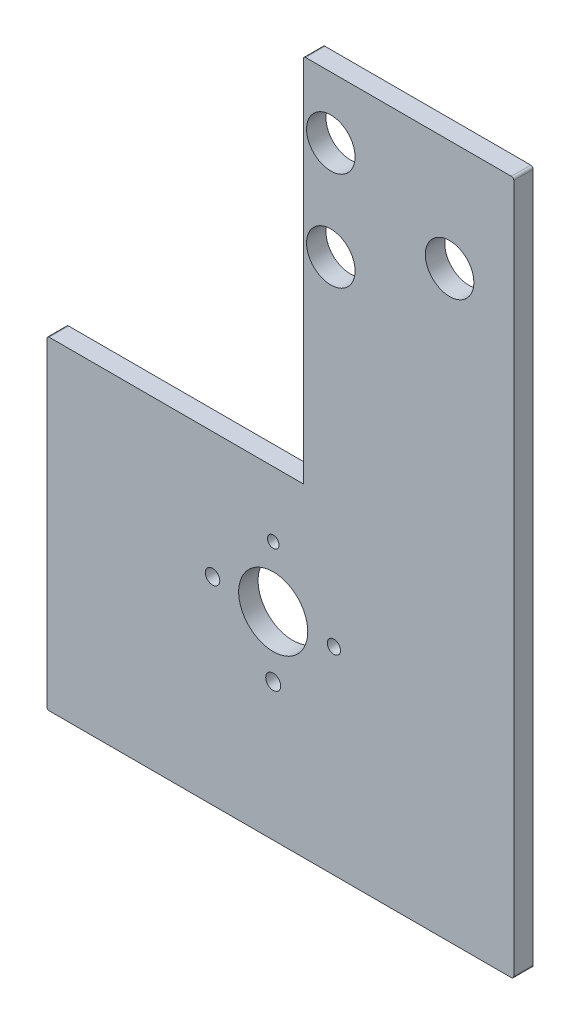
ISO-10303-21;
HEADER;
FILE_DESCRIPTION(('STEP AP214'),'2;1');
FILE_NAME('part.step','',(''),(''),'','','');
FILE_SCHEMA(('AUTOMOTIVE_DESIGN { 1 0 10303 214 1 1 1 1 }'));
ENDSEC;
DATA;
#1=APPLICATION_CONTEXT('core data for automotive mechanical design processes');
#2=APPLICATION_PROTOCOL_DEFINITION('international standard','automotive_design',2000,#1);
#3=PRODUCT_CONTEXT('',#1,'mechanical');
#4=PRODUCT('Part','Part','',(#3));
#5=PRODUCT_RELATED_PRODUCT_CATEGORY('part','',(#4));
#6=PRODUCT_DEFINITION_FORMATION('','',#4);
#7=PRODUCT_DEFINITION_CONTEXT('part definition',#1,'design');
#8=PRODUCT_DEFINITION('design','',#6,#7);
#9=PRODUCT_DEFINITION_SHAPE('','',#8);
#10=(LENGTH_UNIT() NAMED_UNIT(*) SI_UNIT(.MILLI.,.METRE.));
#11=(NAMED_UNIT(*) PLANE_ANGLE_UNIT() SI_UNIT($,.RADIAN.));
#12=(NAMED_UNIT(*) SI_UNIT($,.STERADIAN.) SOLID_ANGLE_UNIT());
#13=UNCERTAINTY_MEASURE_WITH_UNIT(LENGTH_MEASURE(1.E-05),#10,'distance_accuracy_value','');
#14=(GEOMETRIC_REPRESENTATION_CONTEXT(3) GLOBAL_UNCERTAINTY_ASSIGNED_CONTEXT((#13)) GLOBAL_UNIT_ASSIGNED_CONTEXT((#10,
#11,#12)) REPRESENTATION_CONTEXT('',''));
#15=CARTESIAN_POINT('',(0.,0.,0.));
#16=DIRECTION('',(0.,0.,1.));
#17=DIRECTION('',(1.,0.,0.));
#18=AXIS2_PLACEMENT_3D('',#15,#16,#17);
#19=CARTESIAN_POINT('',(4236.3612014789,3654.27949720903,8.));
#20=DIRECTION('',(0.,0.,1.));
#21=DIRECTION('',(1.,0.,0.));
#22=AXIS2_PLACEMENT_3D('',#19,#20,#21);
#23=PLANE('',#22);
#24=CARTESIAN_POINT('',(4113.22331786711,3734.81866702235,8.));
#25=DIRECTION('',(0.,0.,1.));
#26=DIRECTION('',(1.,0.,0.));
#27=AXIS2_PLACEMENT_3D('',#24,#25,#26);
#28=CIRCLE('',#27,2.97826076298102);
#29=CARTESIAN_POINT('',(4116.2015786301,3734.81866702235,8.));
#30=VERTEX_POINT('',#29);
#31=EDGE_CURVE('E291',#30,#30,#28,.T.);
#32=ORIENTED_EDGE('',*,*,#31,.F.);
#33=EDGE_LOOP('',(#32));
#34=FACE_BOUND('',#33,.T.);
#35=CARTESIAN_POINT('',(4138.22331786712,3709.81866702235,8.));
#36=DIRECTION('',(0.,0.,1.));
#37=DIRECTION('',(1.,0.,0.));
#38=AXIS2_PLACEMENT_3D('',#35,#36,#37);
#39=CIRCLE('',#38,3.0863289978673);
#40=CARTESIAN_POINT('',(4141.30964686498,3709.81866702235,8.));
#41=VERTEX_POINT('',#40);
#42=EDGE_CURVE('E293',#41,#41,#39,.T.);
#43=ORIENTED_EDGE('',*,*,#42,.F.);
#44=EDGE_LOOP('',(#43));
#45=FACE_BOUND('',#44,.T.);
#46=CARTESIAN_POINT('',(4163.22331786712,3734.81866702235,8.));
#47=DIRECTION('',(0.,0.,1.));
#48=DIRECTION('',(1.,0.,0.));
#49=AXIS2_PLACEMENT_3D('',#46,#47,#48);
#50=CIRCLE('',#49,2.71965257426806);
#51=CARTESIAN_POINT('',(4165.94297044138,3734.81866702235,8.));
#52=VERTEX_POINT('',#51);
#53=EDGE_CURVE('E299',#52,#52,#50,.T.);
#54=ORIENTED_EDGE('',*,*,#53,.F.);
#55=EDGE_LOOP('',(#54));
#56=FACE_BOUND('',#55,.T.);
#57=CARTESIAN_POINT('',(4138.22331786712,3759.81866702235,8.));
#58=DIRECTION('',(0.,0.,1.));
#59=DIRECTION('',(1.,0.,0.));
#60=AXIS2_PLACEMENT_3D('',#57,#58,#59);
#61=CIRCLE('',#60,2.38879268603217);
#62=CARTESIAN_POINT('',(4140.61211055315,3759.81866702235,8.));
#63=VERTEX_POINT('',#62);
#64=EDGE_CURVE('E305',#63,#63,#61,.T.);
#65=ORIENTED_EDGE('',*,*,#64,.F.);
#66=EDGE_LOOP('',(#65));
#67=FACE_BOUND('',#66,.T.);
#68=CARTESIAN_POINT('',(4161.96045626192,3873.28825994128,8.));
#69=DIRECTION('',(0.,0.,1.));
#70=DIRECTION('',(1.,0.,0.));
#71=AXIS2_PLACEMENT_3D('',#68,#69,#70);
#72=CIRCLE('',#71,9.99999999999979);
#73=CARTESIAN_POINT('',(4171.96045626192,3873.28825994128,8.));
#74=VERTEX_POINT('',#73);
#75=EDGE_CURVE('E320',#74,#74,#72,.T.);
#76=ORIENTED_EDGE('',*,*,#75,.F.);
#77=EDGE_LOOP('',(#76));
#78=FACE_BOUND('',#77,.T.);
#79=CARTESIAN_POINT('',(4210.91125389923,3893.62924206324,8.));
#80=DIRECTION('',(0.,0.,1.));
#81=DIRECTION('',(1.,0.,0.));
#82=AXIS2_PLACEMENT_3D('',#79,#80,#81);
#83=CIRCLE('',#82,9.99999999999979);
#84=CARTESIAN_POINT('',(4220.91125389923,3893.62924206324,8.));
#85=VERTEX_POINT('',#84);
#86=EDGE_CURVE('E155',#85,#85,#83,.T.);
#87=ORIENTED_EDGE('',*,*,#86,.F.);
#88=EDGE_LOOP('',(#87));
#89=FACE_BOUND('',#88,.T.);
#90=CARTESIAN_POINT('',(4236.3612014789,3654.27949720903,8.));
#91=DIRECTION('',(0.,0.,1.));
#92=DIRECTION('',(1.,0.,0.));
#93=AXIS2_PLACEMENT_3D('',#90,#91,#92);
#94=CIRCLE('',#93,0.99999999999989);
#95=CARTESIAN_POINT('',(4236.3612014789,3653.27949720903,8.));
#96=VERTEX_POINT('',#95);
#97=CARTESIAN_POINT('',(4237.3612014789,3654.27949720903,8.));
#98=VERTEX_POINT('',#97);
#99=EDGE_CURVE('E172',#96,#98,#94,.T.);
#100=ORIENTED_EDGE('',*,*,#99,.T.);
#101=DIRECTION('',(0.,1.,0.));
#102=VECTOR('',#101,1.);
#103=CARTESIAN_POINT('',(4237.3612014789,3654.27949720903,8.));
#104=LINE('',#103,#102);
#105=CARTESIAN_POINT('',(4237.3612014789,3938.28823462452,8.));
#106=VERTEX_POINT('',#105);
#107=EDGE_CURVE('E105',#98,#106,#104,.T.);
#108=ORIENTED_EDGE('',*,*,#107,.T.);
#109=CARTESIAN_POINT('',(4236.3612014789,3938.28823462452,8.));
#110=DIRECTION('',(0.,0.,1.));
#111=DIRECTION('',(1.,0.,0.));
#112=AXIS2_PLACEMENT_3D('',#109,#110,#111);
#113=CIRCLE('',#112,0.999999999999668);
#114=CARTESIAN_POINT('',(4236.3612014789,3939.28823462452,8.));
#115=VERTEX_POINT('',#114);
#116=EDGE_CURVE('E196',#106,#115,#113,.T.);
#117=ORIENTED_EDGE('',*,*,#116,.T.);
#118=DIRECTION('',(-1.,0.,0.));
#119=VECTOR('',#118,1.);
#120=CARTESIAN_POINT('',(4151.60608521763,3939.28823462452,8.));
#121=LINE('',#120,#119);
#122=CARTESIAN_POINT('',(4151.60608521763,3939.28823462452,8.));
#123=VERTEX_POINT('',#122);
#124=EDGE_CURVE('E215',#115,#123,#121,.T.);
#125=ORIENTED_EDGE('',*,*,#124,.T.);
#126=CARTESIAN_POINT('',(4151.60608521763,3938.28823462452,8.));
#127=DIRECTION('',(0.,0.,1.));
#128=DIRECTION('',(1.,0.,0.));
#129=AXIS2_PLACEMENT_3D('',#126,#127,#128);
#130=CIRCLE('',#129,0.999999999999668);
#131=CARTESIAN_POINT('',(4150.60608521763,3938.28823462452,8.));
#132=VERTEX_POINT('',#131);
#133=EDGE_CURVE('E212',#123,#132,#130,.T.);
#134=ORIENTED_EDGE('',*,*,#133,.T.);
#135=DIRECTION('',(0.,-1.,0.));
#136=VECTOR('',#135,1.);
#137=CARTESIAN_POINT('',(4150.60608521763,3786.62643227022,8.));
#138=LINE('',#137,#136);
#139=CARTESIAN_POINT('',(4150.60608521763,3786.62643227022,8.));
#140=VERTEX_POINT('',#139);
#141=EDGE_CURVE('E214',#132,#140,#138,.T.);
#142=ORIENTED_EDGE('',*,*,#141,.T.);
#143=DIRECTION('',(-1.,0.,0.));
#144=VECTOR('',#143,1.);
#145=CARTESIAN_POINT('',(4045.92072449099,3786.62643227022,8.));
#146=LINE('',#145,#144);
#147=CARTESIAN_POINT('',(4045.92072449099,3786.62643227022,8.));
#148=VERTEX_POINT('',#147);
#149=EDGE_CURVE('E217',#140,#148,#146,.T.);
#150=ORIENTED_EDGE('',*,*,#149,.T.);
#151=CARTESIAN_POINT('',(4045.92072449099,3785.62643227022,8.));
#152=DIRECTION('',(0.,0.,1.));
#153=DIRECTION('',(1.,0.,0.));
#154=AXIS2_PLACEMENT_3D('',#151,#152,#153);
#155=CIRCLE('',#154,1.00000000000011);
#156=CARTESIAN_POINT('',(4044.92072449099,3785.62643227022,8.));
#157=VERTEX_POINT('',#156);
#158=EDGE_CURVE('E133',#148,#157,#155,.T.);
#159=ORIENTED_EDGE('',*,*,#158,.T.);
#160=DIRECTION('',(0.,-1.,0.));
#161=VECTOR('',#160,1.);
#162=CARTESIAN_POINT('',(4044.92072449099,3654.27949720903,8.));
#163=LINE('',#162,#161);
#164=CARTESIAN_POINT('',(4044.92072449099,3654.27949720903,8.));
#165=VERTEX_POINT('',#164);
#166=EDGE_CURVE('E127',#157,#165,#163,.T.);
#167=ORIENTED_EDGE('',*,*,#166,.T.);
#168=CARTESIAN_POINT('',(4045.92072449099,3654.27949720903,8.));
#169=DIRECTION('',(0.,0.,1.));
#170=DIRECTION('',(1.,0.,0.));
#171=AXIS2_PLACEMENT_3D('',#168,#169,#170);
#172=CIRCLE('',#171,1.00000000000033);
#173=CARTESIAN_POINT('',(4045.92072449099,3653.27949720903,8.));
#174=VERTEX_POINT('',#173);
#175=EDGE_CURVE('E131',#165,#174,#172,.T.);
#176=ORIENTED_EDGE('',*,*,#175,.T.);
#177=DIRECTION('',(1.,0.,0.));
#178=VECTOR('',#177,1.);
#179=CARTESIAN_POINT('',(4236.3612014789,3653.27949720903,8.));
#180=LINE('',#179,#178);
#181=EDGE_CURVE('E53',#174,#96,#180,.T.);
#182=ORIENTED_EDGE('',*,*,#181,.T.);
#183=EDGE_LOOP('',(#100,#108,#117,#125,#134,#142,#150,#159,#167,#176,#182));
#184=FACE_BOUND('',#183,.T.);
#185=CARTESIAN_POINT('',(4161.96045626192,3913.97022418519,8.));
#186=DIRECTION('',(0.,0.,1.));
#187=DIRECTION('',(1.,0.,0.));
#188=AXIS2_PLACEMENT_3D('',#185,#186,#187);
#189=CIRCLE('',#188,9.99999999999979);
#190=CARTESIAN_POINT('',(4171.96045626192,3913.97022418519,8.));
#191=VERTEX_POINT('',#190);
#192=EDGE_CURVE('E326',#191,#191,#189,.T.);
#193=ORIENTED_EDGE('',*,*,#192,.F.);
#194=EDGE_LOOP('',(#193));
#195=FACE_BOUND('',#194,.T.);
#196=CARTESIAN_POINT('',(4138.22331786712,3734.81866702235,8.));
#197=DIRECTION('',(0.,0.,1.));
#198=DIRECTION('',(1.,0.,0.));
#199=AXIS2_PLACEMENT_3D('',#196,#197,#198);
#200=CIRCLE('',#199,14.2376703005214);
#201=CARTESIAN_POINT('',(4152.46098816764,3734.81866702235,8.));
#202=VERTEX_POINT('',#201);
#203=EDGE_CURVE('E314',#202,#202,#200,.T.);
#204=ORIENTED_EDGE('',*,*,#203,.F.);
#205=EDGE_LOOP('',(#204));
#206=FACE_BOUND('',#205,.T.);
#207=ADVANCED_FACE('F36',(#34,#45,#56,#67,#78,#89,#184,#195,#206),#23,.T.);
#208=CARTESIAN_POINT('',(4236.3612014789,3654.27949720903,0.));
#209=DIRECTION('',(0.,0.,1.));
#210=DIRECTION('',(1.,0.,0.));
#211=AXIS2_PLACEMENT_3D('',#208,#209,#210);
#212=PLANE('',#211);
#213=CARTESIAN_POINT('',(4113.22331786711,3734.81866702235,0.));
#214=DIRECTION('',(0.,0.,1.));
#215=DIRECTION('',(1.,0.,0.));
#216=AXIS2_PLACEMENT_3D('',#213,#214,#215);
#217=CIRCLE('',#216,2.97826076298102);
#218=CARTESIAN_POINT('',(4116.2015786301,3734.81866702235,0.));
#219=VERTEX_POINT('',#218);
#220=EDGE_CURVE('E289',#219,#219,#217,.T.);
#221=ORIENTED_EDGE('',*,*,#220,.T.);
#222=EDGE_LOOP('',(#221));
#223=FACE_BOUND('',#222,.T.);
#224=CARTESIAN_POINT('',(4138.22331786712,3709.81866702235,0.));
#225=DIRECTION('',(0.,0.,1.));
#226=DIRECTION('',(1.,0.,0.));
#227=AXIS2_PLACEMENT_3D('',#224,#225,#226);
#228=CIRCLE('',#227,3.0863289978673);
#229=CARTESIAN_POINT('',(4141.30964686498,3709.81866702235,0.));
#230=VERTEX_POINT('',#229);
#231=EDGE_CURVE('E296',#230,#230,#228,.T.);
#232=ORIENTED_EDGE('',*,*,#231,.T.);
#233=EDGE_LOOP('',(#232));
#234=FACE_BOUND('',#233,.T.);
#235=CARTESIAN_POINT('',(4163.22331786712,3734.81866702235,0.));
#236=DIRECTION('',(0.,0.,1.));
#237=DIRECTION('',(1.,0.,0.));
#238=AXIS2_PLACEMENT_3D('',#235,#236,#237);
#239=CIRCLE('',#238,2.71965257426806);
#240=CARTESIAN_POINT('',(4165.94297044138,3734.81866702235,0.));
#241=VERTEX_POINT('',#240);
#242=EDGE_CURVE('E302',#241,#241,#239,.T.);
#243=ORIENTED_EDGE('',*,*,#242,.T.);
#244=EDGE_LOOP('',(#243));
#245=FACE_BOUND('',#244,.T.);
#246=CARTESIAN_POINT('',(4138.22331786712,3759.81866702235,0.));
#247=DIRECTION('',(0.,0.,1.));
#248=DIRECTION('',(1.,0.,0.));
#249=AXIS2_PLACEMENT_3D('',#246,#247,#248);
#250=CIRCLE('',#249,2.38879268603217);
#251=CARTESIAN_POINT('',(4140.61211055315,3759.81866702235,0.));
#252=VERTEX_POINT('',#251);
#253=EDGE_CURVE('E308',#252,#252,#250,.T.);
#254=ORIENTED_EDGE('',*,*,#253,.T.);
#255=EDGE_LOOP('',(#254));
#256=FACE_BOUND('',#255,.T.);
#257=CARTESIAN_POINT('',(4161.96045626192,3873.28825994128,0.));
#258=DIRECTION('',(0.,0.,1.));
#259=DIRECTION('',(1.,0.,0.));
#260=AXIS2_PLACEMENT_3D('',#257,#258,#259);
#261=CIRCLE('',#260,9.99999999999979);
#262=CARTESIAN_POINT('',(4171.96045626192,3873.28825994128,0.));
#263=VERTEX_POINT('',#262);
#264=EDGE_CURVE('E317',#263,#263,#261,.T.);
#265=ORIENTED_EDGE('',*,*,#264,.T.);
#266=EDGE_LOOP('',(#265));
#267=FACE_BOUND('',#266,.T.);
#268=CARTESIAN_POINT('',(4210.91125389923,3893.62924206324,0.));
#269=DIRECTION('',(0.,0.,1.));
#270=DIRECTION('',(1.,0.,0.));
#271=AXIS2_PLACEMENT_3D('',#268,#269,#270);
#272=CIRCLE('',#271,9.99999999999979);
#273=CARTESIAN_POINT('',(4220.91125389923,3893.62924206324,0.));
#274=VERTEX_POINT('',#273);
#275=EDGE_CURVE('E329',#274,#274,#272,.T.);
#276=ORIENTED_EDGE('',*,*,#275,.T.);
#277=EDGE_LOOP('',(#276));
#278=FACE_BOUND('',#277,.T.);
#279=CARTESIAN_POINT('',(4236.3612014789,3654.27949720903,0.));
#280=DIRECTION('',(0.,0.,1.));
#281=DIRECTION('',(1.,0.,0.));
#282=AXIS2_PLACEMENT_3D('',#279,#280,#281);
#283=CIRCLE('',#282,0.99999999999989);
#284=CARTESIAN_POINT('',(4236.3612014789,3653.27949720903,0.));
#285=VERTEX_POINT('',#284);
#286=CARTESIAN_POINT('',(4237.3612014789,3654.27949720903,0.));
#287=VERTEX_POINT('',#286);
#288=EDGE_CURVE('E151',#285,#287,#283,.T.);
#289=ORIENTED_EDGE('',*,*,#288,.F.);
#290=DIRECTION('',(1.,0.,0.));
#291=VECTOR('',#290,1.);
#292=CARTESIAN_POINT('',(4236.3612014789,3653.27949720903,0.));
#293=LINE('',#292,#291);
#294=CARTESIAN_POINT('',(4045.92072449099,3653.27949720903,0.));
#295=VERTEX_POINT('',#294);
#296=EDGE_CURVE('E97',#295,#285,#293,.T.);
#297=ORIENTED_EDGE('',*,*,#296,.F.);
#298=CARTESIAN_POINT('',(4045.92072449099,3654.27949720903,0.));
#299=DIRECTION('',(0.,0.,1.));
#300=DIRECTION('',(1.,0.,0.));
#301=AXIS2_PLACEMENT_3D('',#298,#299,#300);
#302=CIRCLE('',#301,1.00000000000033);
#303=CARTESIAN_POINT('',(4044.92072449099,3654.27949720903,0.));
#304=VERTEX_POINT('',#303);
#305=EDGE_CURVE('E91',#304,#295,#302,.T.);
#306=ORIENTED_EDGE('',*,*,#305,.F.);
#307=DIRECTION('',(0.,-1.,0.));
#308=VECTOR('',#307,1.);
#309=CARTESIAN_POINT('',(4044.92072449099,3654.27949720903,0.));
#310=LINE('',#309,#308);
#311=CARTESIAN_POINT('',(4044.92072449099,3785.62643227022,0.));
#312=VERTEX_POINT('',#311);
#313=EDGE_CURVE('E141',#312,#304,#310,.T.);
#314=ORIENTED_EDGE('',*,*,#313,.F.);
#315=CARTESIAN_POINT('',(4045.92072449099,3785.62643227022,0.));
#316=DIRECTION('',(0.,0.,1.));
#317=DIRECTION('',(1.,0.,0.));
#318=AXIS2_PLACEMENT_3D('',#315,#316,#317);
#319=CIRCLE('',#318,1.00000000000011);
#320=CARTESIAN_POINT('',(4045.92072449099,3786.62643227022,0.));
#321=VERTEX_POINT('',#320);
#322=EDGE_CURVE('E167',#321,#312,#319,.T.);
#323=ORIENTED_EDGE('',*,*,#322,.F.);
#324=DIRECTION('',(-1.,0.,0.));
#325=VECTOR('',#324,1.);
#326=CARTESIAN_POINT('',(4045.92072449099,3786.62643227022,0.));
#327=LINE('',#326,#325);
#328=CARTESIAN_POINT('',(4150.60608521763,3786.62643227022,0.));
#329=VERTEX_POINT('',#328);
#330=EDGE_CURVE('E165',#329,#321,#327,.T.);
#331=ORIENTED_EDGE('',*,*,#330,.F.);
#332=DIRECTION('',(0.,-1.,0.));
#333=VECTOR('',#332,1.);
#334=CARTESIAN_POINT('',(4150.60608521763,3786.62643227022,0.));
#335=LINE('',#334,#333);
#336=CARTESIAN_POINT('',(4150.60608521763,3938.28823462452,0.));
#337=VERTEX_POINT('',#336);
#338=EDGE_CURVE('E163',#337,#329,#335,.T.);
#339=ORIENTED_EDGE('',*,*,#338,.F.);
#340=CARTESIAN_POINT('',(4151.60608521763,3938.28823462452,0.));
#341=DIRECTION('',(0.,0.,1.));
#342=DIRECTION('',(1.,0.,0.));
#343=AXIS2_PLACEMENT_3D('',#340,#341,#342);
#344=CIRCLE('',#343,0.999999999999668);
#345=CARTESIAN_POINT('',(4151.60608521763,3939.28823462452,0.));
#346=VERTEX_POINT('',#345);
#347=EDGE_CURVE('E161',#346,#337,#344,.T.);
#348=ORIENTED_EDGE('',*,*,#347,.F.);
#349=DIRECTION('',(-1.,0.,0.));
#350=VECTOR('',#349,1.);
#351=CARTESIAN_POINT('',(4151.60608521763,3939.28823462452,0.));
#352=LINE('',#351,#350);
#353=CARTESIAN_POINT('',(4236.3612014789,3939.28823462452,0.));
#354=VERTEX_POINT('',#353);
#355=EDGE_CURVE('E159',#354,#346,#352,.T.);
#356=ORIENTED_EDGE('',*,*,#355,.F.);
#357=CARTESIAN_POINT('',(4236.3612014789,3938.28823462452,0.));
#358=DIRECTION('',(0.,0.,1.));
#359=DIRECTION('',(1.,0.,0.));
#360=AXIS2_PLACEMENT_3D('',#357,#358,#359);
#361=CIRCLE('',#360,0.999999999999668);
#362=CARTESIAN_POINT('',(4237.3612014789,3938.28823462452,0.));
#363=VERTEX_POINT('',#362);
#364=EDGE_CURVE('E157',#363,#354,#361,.T.);
#365=ORIENTED_EDGE('',*,*,#364,.F.);
#366=DIRECTION('',(0.,1.,0.));
#367=VECTOR('',#366,1.);
#368=CARTESIAN_POINT('',(4237.3612014789,3654.27949720903,0.));
#369=LINE('',#368,#367);
#370=EDGE_CURVE('E154',#287,#363,#369,.T.);
#371=ORIENTED_EDGE('',*,*,#370,.F.);
#372=EDGE_LOOP('',(#289,#297,#306,#314,#323,#331,#339,#348,#356,#365,#371));
#373=FACE_BOUND('',#372,.T.);
#374=CARTESIAN_POINT('',(4161.96045626192,3913.97022418519,0.));
#375=DIRECTION('',(0.,0.,1.));
#376=DIRECTION('',(1.,0.,0.));
#377=AXIS2_PLACEMENT_3D('',#374,#375,#376);
#378=CIRCLE('',#377,9.99999999999979);
#379=CARTESIAN_POINT('',(4171.96045626192,3913.97022418519,0.));
#380=VERTEX_POINT('',#379);
#381=EDGE_CURVE('E323',#380,#380,#378,.T.);
#382=ORIENTED_EDGE('',*,*,#381,.T.);
#383=EDGE_LOOP('',(#382));
#384=FACE_BOUND('',#383,.T.);
#385=CARTESIAN_POINT('',(4138.22331786712,3734.81866702235,0.));
#386=DIRECTION('',(0.,0.,1.));
#387=DIRECTION('',(1.,0.,0.));
#388=AXIS2_PLACEMENT_3D('',#385,#386,#387);
#389=CIRCLE('',#388,14.2376703005214);
#390=CARTESIAN_POINT('',(4152.46098816764,3734.81866702235,0.));
#391=VERTEX_POINT('',#390);
#392=EDGE_CURVE('E311',#391,#391,#389,.T.);
#393=ORIENTED_EDGE('',*,*,#392,.T.);
#394=EDGE_LOOP('',(#393));
#395=FACE_BOUND('',#394,.T.);
#396=ADVANCED_FACE('F200',(#223,#234,#245,#256,#267,#278,#373,#384,#395),#212,.F.);
#397=CARTESIAN_POINT('',(4236.3612014789,3654.27949720903,8.));
#398=DIRECTION('',(0.,0.,-1.));
#399=DIRECTION('',(-1.,0.,0.));
#400=AXIS2_PLACEMENT_3D('',#397,#398,#399);
#401=CYLINDRICAL_SURFACE('',#400,0.99999999999989);
#402=ORIENTED_EDGE('',*,*,#288,.T.);
#403=DIRECTION('',(0.,0.,-1.));
#404=VECTOR('',#403,1.);
#405=CARTESIAN_POINT('',(4237.3612014789,3654.27949720903,8.));
#406=LINE('',#405,#404);
#407=EDGE_CURVE('E11',#98,#287,#406,.T.);
#408=ORIENTED_EDGE('',*,*,#407,.F.);
#409=ORIENTED_EDGE('',*,*,#99,.F.);
#410=DIRECTION('',(0.,0.,-1.));
#411=VECTOR('',#410,1.);
#412=CARTESIAN_POINT('',(4236.3612014789,3653.27949720903,8.));
#413=LINE('',#412,#411);
#414=EDGE_CURVE('E147',#96,#285,#413,.T.);
#415=ORIENTED_EDGE('',*,*,#414,.T.);
#416=EDGE_LOOP('',(#402,#408,#409,#415));
#417=FACE_BOUND('',#416,.T.);
#418=ADVANCED_FACE('F38',(#417),#401,.T.);
#419=CARTESIAN_POINT('',(4237.3612014789,3654.27949720903,8.));
#420=DIRECTION('',(-1.,0.,0.));
#421=DIRECTION('',(0.,0.,1.));
#422=AXIS2_PLACEMENT_3D('',#419,#420,#421);
#423=PLANE('',#422);
#424=ORIENTED_EDGE('',*,*,#370,.T.);
#425=DIRECTION('',(0.,0.,-1.));
#426=VECTOR('',#425,1.);
#427=CARTESIAN_POINT('',(4237.3612014789,3938.28823462452,8.));
#428=LINE('',#427,#426);
#429=EDGE_CURVE('E45',#106,#363,#428,.T.);
#430=ORIENTED_EDGE('',*,*,#429,.F.);
#431=ORIENTED_EDGE('',*,*,#107,.F.);
#432=ORIENTED_EDGE('',*,*,#407,.T.);
#433=EDGE_LOOP('',(#424,#430,#431,#432));
#434=FACE_BOUND('',#433,.T.);
#435=ADVANCED_FACE('F465',(#434),#423,.F.);
#436=CARTESIAN_POINT('',(4236.3612014789,3938.28823462452,8.));
#437=DIRECTION('',(0.,0.,-1.));
#438=DIRECTION('',(-1.,0.,0.));
#439=AXIS2_PLACEMENT_3D('',#436,#437,#438);
#440=CYLINDRICAL_SURFACE('',#439,0.999999999999668);
#441=ORIENTED_EDGE('',*,*,#364,.T.);
#442=DIRECTION('',(0.,0.,-1.));
#443=VECTOR('',#442,1.);
#444=CARTESIAN_POINT('',(4236.3612014789,3939.28823462452,8.));
#445=LINE('',#444,#443);
#446=EDGE_CURVE('E188',#115,#354,#445,.T.);
#447=ORIENTED_EDGE('',*,*,#446,.F.);
#448=ORIENTED_EDGE('',*,*,#116,.F.);
#449=ORIENTED_EDGE('',*,*,#429,.T.);
#450=EDGE_LOOP('',(#441,#447,#448,#449));
#451=FACE_BOUND('',#450,.T.);
#452=ADVANCED_FACE('F194',(#451),#440,.T.);
#453=CARTESIAN_POINT('',(4151.60608521763,3939.28823462452,8.));
#454=DIRECTION('',(0.,-1.,0.));
#455=DIRECTION('',(0.,0.,-1.));
#456=AXIS2_PLACEMENT_3D('',#453,#454,#455);
#457=PLANE('',#456);
#458=ORIENTED_EDGE('',*,*,#355,.T.);
#459=DIRECTION('',(0.,0.,-1.));
#460=VECTOR('',#459,1.);
#461=CARTESIAN_POINT('',(4151.60608521763,3939.28823462452,8.));
#462=LINE('',#461,#460);
#463=EDGE_CURVE('E185',#123,#346,#462,.T.);
#464=ORIENTED_EDGE('',*,*,#463,.F.);
#465=ORIENTED_EDGE('',*,*,#124,.F.);
#466=ORIENTED_EDGE('',*,*,#446,.T.);
#467=EDGE_LOOP('',(#458,#464,#465,#466));
#468=FACE_BOUND('',#467,.T.);
#469=ADVANCED_FACE('F206',(#468),#457,.F.);
#470=CARTESIAN_POINT('',(4151.60608521763,3938.28823462452,8.));
#471=DIRECTION('',(0.,0.,-1.));
#472=DIRECTION('',(-1.,0.,0.));
#473=AXIS2_PLACEMENT_3D('',#470,#471,#472);
#474=CYLINDRICAL_SURFACE('',#473,0.999999999999668);
#475=ORIENTED_EDGE('',*,*,#347,.T.);
#476=DIRECTION('',(0.,0.,-1.));
#477=VECTOR('',#476,1.);
#478=CARTESIAN_POINT('',(4150.60608521763,3938.28823462452,8.));
#479=LINE('',#478,#477);
#480=EDGE_CURVE('E182',#132,#337,#479,.T.);
#481=ORIENTED_EDGE('',*,*,#480,.F.);
#482=ORIENTED_EDGE('',*,*,#133,.F.);
#483=ORIENTED_EDGE('',*,*,#463,.T.);
#484=EDGE_LOOP('',(#475,#481,#482,#483));
#485=FACE_BOUND('',#484,.T.);
#486=ADVANCED_FACE('F210',(#485),#474,.T.);
#487=CARTESIAN_POINT('',(4150.60608521763,3786.62643227022,8.));
#488=DIRECTION('',(1.,0.,0.));
#489=DIRECTION('',(0.,0.,-1.));
#490=AXIS2_PLACEMENT_3D('',#487,#488,#489);
#491=PLANE('',#490);
#492=ORIENTED_EDGE('',*,*,#338,.T.);
#493=DIRECTION('',(0.,0.,-1.));
#494=VECTOR('',#493,1.);
#495=CARTESIAN_POINT('',(4150.60608521763,3786.62643227022,8.));
#496=LINE('',#495,#494);
#497=EDGE_CURVE('E179',#140,#329,#496,.T.);
#498=ORIENTED_EDGE('',*,*,#497,.F.);
#499=ORIENTED_EDGE('',*,*,#141,.F.);
#500=ORIENTED_EDGE('',*,*,#480,.T.);
#501=EDGE_LOOP('',(#492,#498,#499,#500));
#502=FACE_BOUND('',#501,.T.);
#503=ADVANCED_FACE('F431',(#502),#491,.F.);
#504=CARTESIAN_POINT('',(4045.92072449099,3786.62643227022,8.));
#505=DIRECTION('',(0.,-1.,0.));
#506=DIRECTION('',(0.,0.,-1.));
#507=AXIS2_PLACEMENT_3D('',#504,#505,#506);
#508=PLANE('',#507);
#509=ORIENTED_EDGE('',*,*,#330,.T.);
#510=DIRECTION('',(0.,0.,-1.));
#511=VECTOR('',#510,1.);
#512=CARTESIAN_POINT('',(4045.92072449099,3786.62643227022,8.));
#513=LINE('',#512,#511);
#514=EDGE_CURVE('E176',#148,#321,#513,.T.);
#515=ORIENTED_EDGE('',*,*,#514,.F.);
#516=ORIENTED_EDGE('',*,*,#149,.F.);
#517=ORIENTED_EDGE('',*,*,#497,.T.);
#518=EDGE_LOOP('',(#509,#515,#516,#517));
#519=FACE_BOUND('',#518,.T.);
#520=ADVANCED_FACE('F226',(#519),#508,.F.);
#521=CARTESIAN_POINT('',(4045.92072449099,3785.62643227022,8.));
#522=DIRECTION('',(0.,0.,-1.));
#523=DIRECTION('',(-1.,0.,0.));
#524=AXIS2_PLACEMENT_3D('',#521,#522,#523);
#525=CYLINDRICAL_SURFACE('',#524,1.00000000000011);
#526=ORIENTED_EDGE('',*,*,#322,.T.);
#527=DIRECTION('',(0.,0.,-1.));
#528=VECTOR('',#527,1.);
#529=CARTESIAN_POINT('',(4044.92072449099,3785.62643227022,8.));
#530=LINE('',#529,#528);
#531=EDGE_CURVE('E142',#157,#312,#530,.T.);
#532=ORIENTED_EDGE('',*,*,#531,.F.);
#533=ORIENTED_EDGE('',*,*,#158,.F.);
#534=ORIENTED_EDGE('',*,*,#514,.T.);
#535=EDGE_LOOP('',(#526,#532,#533,#534));
#536=FACE_BOUND('',#535,.T.);
#537=ADVANCED_FACE('F230',(#536),#525,.T.);
#538=CARTESIAN_POINT('',(4044.92072449099,3654.27949720903,8.));
#539=DIRECTION('',(1.,0.,0.));
#540=DIRECTION('',(0.,0.,-1.));
#541=AXIS2_PLACEMENT_3D('',#538,#539,#540);
#542=PLANE('',#541);
#543=ORIENTED_EDGE('',*,*,#313,.T.);
#544=DIRECTION('',(0.,0.,-1.));
#545=VECTOR('',#544,1.);
#546=CARTESIAN_POINT('',(4044.92072449099,3654.27949720903,8.));
#547=LINE('',#546,#545);
#548=EDGE_CURVE('E138',#165,#304,#547,.T.);
#549=ORIENTED_EDGE('',*,*,#548,.F.);
#550=ORIENTED_EDGE('',*,*,#166,.F.);
#551=ORIENTED_EDGE('',*,*,#531,.T.);
#552=EDGE_LOOP('',(#543,#549,#550,#551));
#553=FACE_BOUND('',#552,.T.);
#554=ADVANCED_FACE('F139',(#553),#542,.F.);
#555=CARTESIAN_POINT('',(4045.92072449099,3654.27949720903,8.));
#556=DIRECTION('',(0.,0.,-1.));
#557=DIRECTION('',(-1.,0.,0.));
#558=AXIS2_PLACEMENT_3D('',#555,#556,#557);
#559=CYLINDRICAL_SURFACE('',#558,1.00000000000033);
#560=ORIENTED_EDGE('',*,*,#305,.T.);
#561=DIRECTION('',(0.,0.,-1.));
#562=VECTOR('',#561,1.);
#563=CARTESIAN_POINT('',(4045.92072449099,3653.27949720903,8.));
#564=LINE('',#563,#562);
#565=EDGE_CURVE('E143',#174,#295,#564,.T.);
#566=ORIENTED_EDGE('',*,*,#565,.F.);
#567=ORIENTED_EDGE('',*,*,#175,.F.);
#568=ORIENTED_EDGE('',*,*,#548,.T.);
#569=EDGE_LOOP('',(#560,#566,#567,#568));
#570=FACE_BOUND('',#569,.T.);
#571=ADVANCED_FACE('F145',(#570),#559,.T.);
#572=CARTESIAN_POINT('',(4236.3612014789,3653.27949720903,8.));
#573=DIRECTION('',(0.,1.,0.));
#574=DIRECTION('',(-1.,0.,0.));
#575=AXIS2_PLACEMENT_3D('',#572,#573,#574);
#576=PLANE('',#575);
#577=ORIENTED_EDGE('',*,*,#296,.T.);
#578=ORIENTED_EDGE('',*,*,#414,.F.);
#579=ORIENTED_EDGE('',*,*,#181,.F.);
#580=ORIENTED_EDGE('',*,*,#565,.T.);
#581=EDGE_LOOP('',(#577,#578,#579,#580));
#582=FACE_BOUND('',#581,.T.);
#583=ADVANCED_FACE('F234',(#582),#576,.F.);
#584=CARTESIAN_POINT('',(4210.91125389923,3893.62924206324,8.));
#585=DIRECTION('',(0.,0.,-1.));
#586=DIRECTION('',(-1.,0.,0.));
#587=AXIS2_PLACEMENT_3D('',#584,#585,#586);
#588=CYLINDRICAL_SURFACE('',#587,9.99999999999979);
#589=ORIENTED_EDGE('',*,*,#86,.T.);
#590=EDGE_LOOP('',(#589));
#591=FACE_BOUND('',#590,.T.);
#592=ORIENTED_EDGE('',*,*,#275,.F.);
#593=EDGE_LOOP('',(#592));
#594=FACE_BOUND('',#593,.T.);
#595=ADVANCED_FACE('F236',(#591,#594),#588,.F.);
#596=CARTESIAN_POINT('',(4161.96045626192,3913.97022418519,8.));
#597=DIRECTION('',(0.,0.,-1.));
#598=DIRECTION('',(-1.,0.,0.));
#599=AXIS2_PLACEMENT_3D('',#596,#597,#598);
#600=CYLINDRICAL_SURFACE('',#599,9.99999999999979);
#601=ORIENTED_EDGE('',*,*,#192,.T.);
#602=EDGE_LOOP('',(#601));
#603=FACE_BOUND('',#602,.T.);
#604=ORIENTED_EDGE('',*,*,#381,.F.);
#605=EDGE_LOOP('',(#604));
#606=FACE_BOUND('',#605,.T.);
#607=ADVANCED_FACE('F242',(#603,#606),#600,.F.);
#608=CARTESIAN_POINT('',(4161.96045626192,3873.28825994128,8.));
#609=DIRECTION('',(0.,0.,-1.));
#610=DIRECTION('',(-1.,0.,0.));
#611=AXIS2_PLACEMENT_3D('',#608,#609,#610);
#612=CYLINDRICAL_SURFACE('',#611,9.99999999999979);
#613=ORIENTED_EDGE('',*,*,#75,.T.);
#614=EDGE_LOOP('',(#613));
#615=FACE_BOUND('',#614,.T.);
#616=ORIENTED_EDGE('',*,*,#264,.F.);
#617=EDGE_LOOP('',(#616));
#618=FACE_BOUND('',#617,.T.);
#619=ADVANCED_FACE('F260',(#615,#618),#612,.F.);
#620=CARTESIAN_POINT('',(4138.22331786712,3734.81866702235,8.));
#621=DIRECTION('',(0.,0.,-1.));
#622=DIRECTION('',(-1.,0.,0.));
#623=AXIS2_PLACEMENT_3D('',#620,#621,#622);
#624=CYLINDRICAL_SURFACE('',#623,14.2376703005214);
#625=ORIENTED_EDGE('',*,*,#203,.T.);
#626=EDGE_LOOP('',(#625));
#627=FACE_BOUND('',#626,.T.);
#628=ORIENTED_EDGE('',*,*,#392,.F.);
#629=EDGE_LOOP('',(#628));
#630=FACE_BOUND('',#629,.T.);
#631=ADVANCED_FACE('F264',(#627,#630),#624,.F.);
#632=CARTESIAN_POINT('',(4138.22331786712,3759.81866702235,0.));
#633=DIRECTION('',(0.,0.,1.));
#634=DIRECTION('',(1.,0.,0.));
#635=AXIS2_PLACEMENT_3D('',#632,#633,#634);
#636=CYLINDRICAL_SURFACE('',#635,2.38879268603217);
#637=ORIENTED_EDGE('',*,*,#253,.F.);
#638=EDGE_LOOP('',(#637));
#639=FACE_BOUND('',#638,.T.);
#640=ORIENTED_EDGE('',*,*,#64,.T.);
#641=EDGE_LOOP('',(#640));
#642=FACE_BOUND('',#641,.T.);
#643=ADVANCED_FACE('F268',(#639,#642),#636,.F.);
#644=CARTESIAN_POINT('',(4163.22331786712,3734.81866702235,0.));
#645=DIRECTION('',(0.,0.,1.));
#646=DIRECTION('',(1.,0.,0.));
#647=AXIS2_PLACEMENT_3D('',#644,#645,#646);
#648=CYLINDRICAL_SURFACE('',#647,2.71965257426806);
#649=ORIENTED_EDGE('',*,*,#242,.F.);
#650=EDGE_LOOP('',(#649));
#651=FACE_BOUND('',#650,.T.);
#652=ORIENTED_EDGE('',*,*,#53,.T.);
#653=EDGE_LOOP('',(#652));
#654=FACE_BOUND('',#653,.T.);
#655=ADVANCED_FACE('F272',(#651,#654),#648,.F.);
#656=CARTESIAN_POINT('',(4138.22331786712,3709.81866702235,0.));
#657=DIRECTION('',(0.,0.,1.));
#658=DIRECTION('',(1.,0.,0.));
#659=AXIS2_PLACEMENT_3D('',#656,#657,#658);
#660=CYLINDRICAL_SURFACE('',#659,3.0863289978673);
#661=ORIENTED_EDGE('',*,*,#231,.F.);
#662=EDGE_LOOP('',(#661));
#663=FACE_BOUND('',#662,.T.);
#664=ORIENTED_EDGE('',*,*,#42,.T.);
#665=EDGE_LOOP('',(#664));
#666=FACE_BOUND('',#665,.T.);
#667=ADVANCED_FACE('F276',(#663,#666),#660,.F.);
#668=CARTESIAN_POINT('',(4113.22331786711,3734.81866702235,0.));
#669=DIRECTION('',(0.,0.,1.));
#670=DIRECTION('',(1.,0.,0.));
#671=AXIS2_PLACEMENT_3D('',#668,#669,#670);
#672=CYLINDRICAL_SURFACE('',#671,2.97826076298102);
#673=ORIENTED_EDGE('',*,*,#220,.F.);
#674=EDGE_LOOP('',(#673));
#675=FACE_BOUND('',#674,.T.);
#676=ORIENTED_EDGE('',*,*,#31,.T.);
#677=EDGE_LOOP('',(#676));
#678=FACE_BOUND('',#677,.T.);
#679=ADVANCED_FACE('F280',(#675,#678),#672,.F.);
#680=CLOSED_SHELL('',(#207,#396,#418,#435,#452,#469,#486,#503,#520,#537,#554,#571,#583,#595,
#607,#619,#631,#643,#655,#667,#679));
#681=MANIFOLD_SOLID_BREP('B2',#680);
#682=ADVANCED_BREP_SHAPE_REPRESENTATION('',(#18,#681),#14);
#683=SHAPE_DEFINITION_REPRESENTATION(#9,#682);
ENDSEC;
END-ISO-10303-21;
